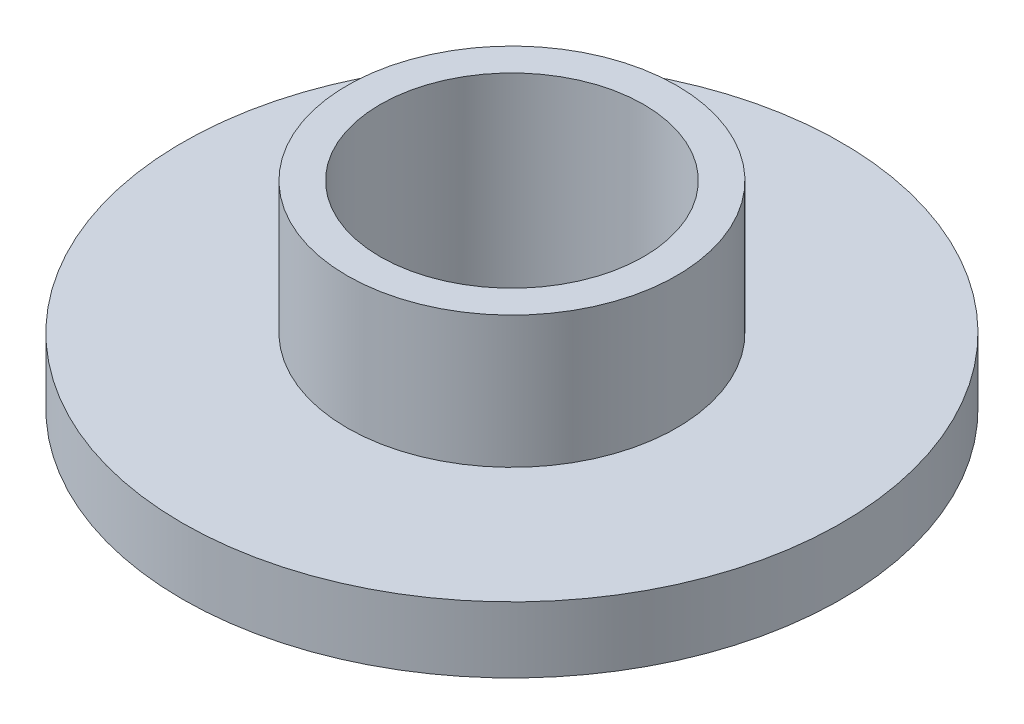
ISO-10303-21;
HEADER;
FILE_DESCRIPTION(('STEP AP214'),'2;1');
FILE_NAME('part.step','',(''),(''),'','','');
FILE_SCHEMA(('AUTOMOTIVE_DESIGN { 1 0 10303 214 1 1 1 1 }'));
ENDSEC;
DATA;
#1=APPLICATION_CONTEXT('core data for automotive mechanical design processes');
#2=APPLICATION_PROTOCOL_DEFINITION('international standard','automotive_design',2000,#1);
#3=PRODUCT_CONTEXT('',#1,'mechanical');
#4=PRODUCT('Part','Part','',(#3));
#5=PRODUCT_RELATED_PRODUCT_CATEGORY('part','',(#4));
#6=PRODUCT_DEFINITION_FORMATION('','',#4);
#7=PRODUCT_DEFINITION_CONTEXT('part definition',#1,'design');
#8=PRODUCT_DEFINITION('design','',#6,#7);
#9=PRODUCT_DEFINITION_SHAPE('','',#8);
#10=(LENGTH_UNIT() NAMED_UNIT(*) SI_UNIT(.MILLI.,.METRE.));
#11=(NAMED_UNIT(*) PLANE_ANGLE_UNIT() SI_UNIT($,.RADIAN.));
#12=(NAMED_UNIT(*) SI_UNIT($,.STERADIAN.) SOLID_ANGLE_UNIT());
#13=UNCERTAINTY_MEASURE_WITH_UNIT(LENGTH_MEASURE(1.E-05),#10,'distance_accuracy_value','');
#14=(GEOMETRIC_REPRESENTATION_CONTEXT(3) GLOBAL_UNCERTAINTY_ASSIGNED_CONTEXT((#13)) GLOBAL_UNIT_ASSIGNED_CONTEXT((#10,
#11,#12)) REPRESENTATION_CONTEXT('',''));
#15=CARTESIAN_POINT('',(0.,0.,0.));
#16=DIRECTION('',(0.,0.,1.));
#17=DIRECTION('',(1.,0.,0.));
#18=AXIS2_PLACEMENT_3D('',#15,#16,#17);
#19=CARTESIAN_POINT('',(0.,0.,0.));
#20=DIRECTION('',(0.,1.,0.));
#21=DIRECTION('',(0.,0.,1.));
#22=AXIS2_PLACEMENT_3D('',#19,#20,#21);
#23=PLANE('',#22);
#24=CARTESIAN_POINT('',(0.,0.,0.));
#25=DIRECTION('',(0.,1.,0.));
#26=DIRECTION('',(0.,0.,1.));
#27=AXIS2_PLACEMENT_3D('',#24,#25,#26);
#28=CIRCLE('',#27,7.9375);
#29=CARTESIAN_POINT('',(0.,0.,7.9375));
#30=VERTEX_POINT('',#29);
#31=EDGE_CURVE('E48',#30,#30,#28,.T.);
#32=ORIENTED_EDGE('',*,*,#31,.F.);
#33=EDGE_LOOP('',(#32));
#34=FACE_BOUND('',#33,.T.);
#35=CARTESIAN_POINT('',(0.,0.,0.));
#36=DIRECTION('',(0.,1.,0.));
#37=DIRECTION('',(0.,0.,1.));
#38=AXIS2_PLACEMENT_3D('',#35,#36,#37);
#39=CIRCLE('',#38,3.937);
#40=CARTESIAN_POINT('',(0.,0.,3.937));
#41=VERTEX_POINT('',#40);
#42=EDGE_CURVE('E11',#41,#41,#39,.F.);
#43=ORIENTED_EDGE('',*,*,#42,.F.);
#44=EDGE_LOOP('',(#43));
#45=FACE_BOUND('',#44,.T.);
#46=ADVANCED_FACE('F37',(#34,#45),#23,.F.);
#47=CARTESIAN_POINT('',(0.,1.5875,0.));
#48=DIRECTION('',(0.,1.,0.));
#49=DIRECTION('',(0.,0.,1.));
#50=AXIS2_PLACEMENT_3D('',#47,#48,#49);
#51=PLANE('',#50);
#52=CARTESIAN_POINT('',(0.,1.5875,0.));
#53=DIRECTION('',(0.,1.,0.));
#54=DIRECTION('',(0.,0.,1.));
#55=AXIS2_PLACEMENT_3D('',#52,#53,#54);
#56=CIRCLE('',#55,7.9375);
#57=CARTESIAN_POINT('',(0.,1.5875,7.9375));
#58=VERTEX_POINT('',#57);
#59=EDGE_CURVE('E44',#58,#58,#56,.T.);
#60=ORIENTED_EDGE('',*,*,#59,.T.);
#61=EDGE_LOOP('',(#60));
#62=FACE_BOUND('',#61,.T.);
#63=CARTESIAN_POINT('',(0.,1.5875,0.));
#64=DIRECTION('',(0.,1.,0.));
#65=DIRECTION('',(0.,0.,1.));
#66=AXIS2_PLACEMENT_3D('',#63,#64,#65);
#67=CIRCLE('',#66,3.96875);
#68=CARTESIAN_POINT('',(0.,1.5875,3.96875));
#69=VERTEX_POINT('',#68);
#70=EDGE_CURVE('E55',#69,#69,#67,.T.);
#71=ORIENTED_EDGE('',*,*,#70,.F.);
#72=EDGE_LOOP('',(#71));
#73=FACE_BOUND('',#72,.T.);
#74=ADVANCED_FACE('F88',(#62,#73),#51,.T.);
#75=CARTESIAN_POINT('',(0.,1.5875,0.));
#76=DIRECTION('',(0.,-1.,0.));
#77=DIRECTION('',(0.,0.,-1.));
#78=AXIS2_PLACEMENT_3D('',#75,#76,#77);
#79=CYLINDRICAL_SURFACE('',#78,7.9375);
#80=ORIENTED_EDGE('',*,*,#59,.F.);
#81=EDGE_LOOP('',(#80));
#82=FACE_BOUND('',#81,.T.);
#83=ORIENTED_EDGE('',*,*,#31,.T.);
#84=EDGE_LOOP('',(#83));
#85=FACE_BOUND('',#84,.T.);
#86=ADVANCED_FACE('F39',(#82,#85),#79,.T.);
#87=CARTESIAN_POINT('',(0.,1.5875,0.));
#88=DIRECTION('',(0.,-1.,0.));
#89=DIRECTION('',(0.,0.,-1.));
#90=AXIS2_PLACEMENT_3D('',#87,#88,#89);
#91=CYLINDRICAL_SURFACE('',#90,3.175);
#92=CARTESIAN_POINT('',(0.,4.7625,0.));
#93=DIRECTION('',(0.,1.,0.));
#94=DIRECTION('',(0.,0.,1.));
#95=AXIS2_PLACEMENT_3D('',#92,#93,#94);
#96=CIRCLE('',#95,3.175);
#97=CARTESIAN_POINT('',(0.,4.7625,3.175));
#98=VERTEX_POINT('',#97);
#99=EDGE_CURVE('E58',#98,#98,#96,.T.);
#100=ORIENTED_EDGE('',*,*,#99,.T.);
#101=EDGE_LOOP('',(#100));
#102=FACE_BOUND('',#101,.T.);
#103=CARTESIAN_POINT('',(0.,-0.79375,0.));
#104=DIRECTION('',(0.,-1.,0.));
#105=DIRECTION('',(0.,0.,-1.));
#106=AXIS2_PLACEMENT_3D('',#103,#104,#105);
#107=CIRCLE('',#106,3.175);
#108=CARTESIAN_POINT('',(0.,-0.79375,-3.175));
#109=VERTEX_POINT('',#108);
#110=EDGE_CURVE('E66',#109,#109,#107,.T.);
#111=ORIENTED_EDGE('',*,*,#110,.T.);
#112=EDGE_LOOP('',(#111));
#113=FACE_BOUND('',#112,.T.);
#114=ADVANCED_FACE('F70',(#102,#113),#91,.F.);
#115=CARTESIAN_POINT('',(0.,4.7625,0.));
#116=DIRECTION('',(0.,1.,0.));
#117=DIRECTION('',(0.,0.,1.));
#118=AXIS2_PLACEMENT_3D('',#115,#116,#117);
#119=PLANE('',#118);
#120=CARTESIAN_POINT('',(0.,4.7625,0.));
#121=DIRECTION('',(0.,1.,0.));
#122=DIRECTION('',(0.,0.,1.));
#123=AXIS2_PLACEMENT_3D('',#120,#121,#122);
#124=CIRCLE('',#123,3.96875);
#125=CARTESIAN_POINT('',(0.,4.7625,3.96875));
#126=VERTEX_POINT('',#125);
#127=EDGE_CURVE('E53',#126,#126,#124,.T.);
#128=ORIENTED_EDGE('',*,*,#127,.T.);
#129=EDGE_LOOP('',(#128));
#130=FACE_BOUND('',#129,.T.);
#131=ORIENTED_EDGE('',*,*,#99,.F.);
#132=EDGE_LOOP('',(#131));
#133=FACE_BOUND('',#132,.T.);
#134=ADVANCED_FACE('F84',(#130,#133),#119,.T.);
#135=CARTESIAN_POINT('',(0.,4.7625,0.));
#136=DIRECTION('',(0.,-1.,0.));
#137=DIRECTION('',(0.,0.,-1.));
#138=AXIS2_PLACEMENT_3D('',#135,#136,#137);
#139=CYLINDRICAL_SURFACE('',#138,3.96875);
#140=ORIENTED_EDGE('',*,*,#127,.F.);
#141=EDGE_LOOP('',(#140));
#142=FACE_BOUND('',#141,.T.);
#143=ORIENTED_EDGE('',*,*,#70,.T.);
#144=EDGE_LOOP('',(#143));
#145=FACE_BOUND('',#144,.T.);
#146=ADVANCED_FACE('F75',(#142,#145),#139,.T.);
#147=CARTESIAN_POINT('',(0.,-0.79375,0.));
#148=DIRECTION('',(0.,-1.,0.));
#149=DIRECTION('',(0.,0.,-1.));
#150=AXIS2_PLACEMENT_3D('',#147,#148,#149);
#151=PLANE('',#150);
#152=CARTESIAN_POINT('',(0.,-0.79375,0.));
#153=DIRECTION('',(0.,-1.,0.));
#154=DIRECTION('',(0.,0.,-1.));
#155=AXIS2_PLACEMENT_3D('',#152,#153,#154);
#156=CIRCLE('',#155,3.937);
#157=CARTESIAN_POINT('',(0.,-0.79375,-3.937));
#158=VERTEX_POINT('',#157);
#159=EDGE_CURVE('E63',#158,#158,#156,.T.);
#160=ORIENTED_EDGE('',*,*,#159,.T.);
#161=EDGE_LOOP('',(#160));
#162=FACE_BOUND('',#161,.T.);
#163=ORIENTED_EDGE('',*,*,#110,.F.);
#164=EDGE_LOOP('',(#163));
#165=FACE_BOUND('',#164,.T.);
#166=ADVANCED_FACE('F72',(#162,#165),#151,.T.);
#167=CARTESIAN_POINT('',(0.,-0.79375,0.));
#168=DIRECTION('',(0.,1.,0.));
#169=DIRECTION('',(0.,0.,1.));
#170=AXIS2_PLACEMENT_3D('',#167,#168,#169);
#171=CYLINDRICAL_SURFACE('',#170,3.937);
#172=ORIENTED_EDGE('',*,*,#159,.F.);
#173=EDGE_LOOP('',(#172));
#174=FACE_BOUND('',#173,.T.);
#175=ORIENTED_EDGE('',*,*,#42,.T.);
#176=EDGE_LOOP('',(#175));
#177=FACE_BOUND('',#176,.T.);
#178=ADVANCED_FACE('F74',(#174,#177),#171,.T.);
#179=CLOSED_SHELL('',(#46,#74,#86,#114,#134,#146,#166,#178));
#180=MANIFOLD_SOLID_BREP('B2',#179);
#181=ADVANCED_BREP_SHAPE_REPRESENTATION('',(#18,#180),#14);
#182=SHAPE_DEFINITION_REPRESENTATION(#9,#181);
ENDSEC;
END-ISO-10303-21;
